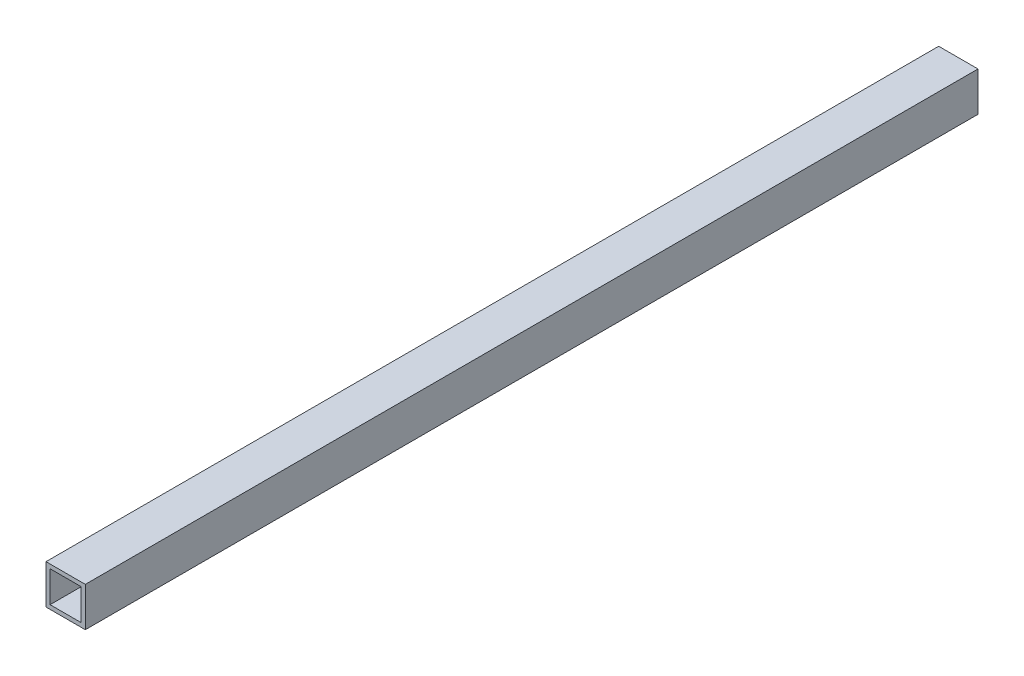
ISO-10303-21;
HEADER;
FILE_DESCRIPTION(('STEP AP214'),'2;1');
FILE_NAME('part.step','',(''),(''),'','','');
FILE_SCHEMA(('AUTOMOTIVE_DESIGN { 1 0 10303 214 1 1 1 1 }'));
ENDSEC;
DATA;
#1=APPLICATION_CONTEXT('core data for automotive mechanical design processes');
#2=APPLICATION_PROTOCOL_DEFINITION('international standard','automotive_design',2000,#1);
#3=PRODUCT_CONTEXT('',#1,'mechanical');
#4=PRODUCT('Part','Part','',(#3));
#5=PRODUCT_RELATED_PRODUCT_CATEGORY('part','',(#4));
#6=PRODUCT_DEFINITION_FORMATION('','',#4);
#7=PRODUCT_DEFINITION_CONTEXT('part definition',#1,'design');
#8=PRODUCT_DEFINITION('design','',#6,#7);
#9=PRODUCT_DEFINITION_SHAPE('','',#8);
#10=(LENGTH_UNIT() NAMED_UNIT(*) SI_UNIT(.MILLI.,.METRE.));
#11=(NAMED_UNIT(*) PLANE_ANGLE_UNIT() SI_UNIT($,.RADIAN.));
#12=(NAMED_UNIT(*) SI_UNIT($,.STERADIAN.) SOLID_ANGLE_UNIT());
#13=UNCERTAINTY_MEASURE_WITH_UNIT(LENGTH_MEASURE(1.E-05),#10,'distance_accuracy_value','');
#14=(GEOMETRIC_REPRESENTATION_CONTEXT(3) GLOBAL_UNCERTAINTY_ASSIGNED_CONTEXT((#13)) GLOBAL_UNIT_ASSIGNED_CONTEXT((#10,
#11,#12)) REPRESENTATION_CONTEXT('',''));
#15=CARTESIAN_POINT('',(0.,0.,0.));
#16=DIRECTION('',(0.,0.,1.));
#17=DIRECTION('',(1.,0.,0.));
#18=AXIS2_PLACEMENT_3D('',#15,#16,#17);
#19=CARTESIAN_POINT('',(0.,0.,545.));
#20=DIRECTION('',(0.,0.,-1.));
#21=DIRECTION('',(-1.,0.,0.));
#22=AXIS2_PLACEMENT_3D('',#19,#20,#21);
#23=PLANE('',#22);
#24=DIRECTION('',(0.,-1.,0.));
#25=VECTOR('',#24,1.);
#26=CARTESIAN_POINT('',(0.,0.,545.));
#27=LINE('',#26,#25);
#28=CARTESIAN_POINT('',(0.,24.,545.));
#29=VERTEX_POINT('',#28);
#30=CARTESIAN_POINT('',(0.,0.,545.));
#31=VERTEX_POINT('',#30);
#32=EDGE_CURVE('E136',#29,#31,#27,.T.);
#33=ORIENTED_EDGE('',*,*,#32,.T.);
#34=DIRECTION('',(1.,0.,0.));
#35=VECTOR('',#34,1.);
#36=CARTESIAN_POINT('',(0.,0.,545.));
#37=LINE('',#36,#35);
#38=CARTESIAN_POINT('',(24.,0.,545.));
#39=VERTEX_POINT('',#38);
#40=EDGE_CURVE('E139',#31,#39,#37,.T.);
#41=ORIENTED_EDGE('',*,*,#40,.T.);
#42=DIRECTION('',(0.,1.,0.));
#43=VECTOR('',#42,1.);
#44=CARTESIAN_POINT('',(24.,0.,545.));
#45=LINE('',#44,#43);
#46=CARTESIAN_POINT('',(24.,24.,545.));
#47=VERTEX_POINT('',#46);
#48=EDGE_CURVE('E142',#39,#47,#45,.T.);
#49=ORIENTED_EDGE('',*,*,#48,.T.);
#50=DIRECTION('',(-1.,0.,0.));
#51=VECTOR('',#50,1.);
#52=CARTESIAN_POINT('',(0.,24.,545.));
#53=LINE('',#52,#51);
#54=EDGE_CURVE('E144',#47,#29,#53,.T.);
#55=ORIENTED_EDGE('',*,*,#54,.T.);
#56=EDGE_LOOP('',(#33,#41,#49,#55));
#57=FACE_BOUND('',#56,.T.);
#58=DIRECTION('',(0.,-1.,0.));
#59=VECTOR('',#58,1.);
#60=CARTESIAN_POINT('',(2.5,2.5,545.));
#61=LINE('',#60,#59);
#62=CARTESIAN_POINT('',(2.5,21.5,545.));
#63=VERTEX_POINT('',#62);
#64=CARTESIAN_POINT('',(2.5,2.5,545.));
#65=VERTEX_POINT('',#64);
#66=EDGE_CURVE('E100',#63,#65,#61,.T.);
#67=ORIENTED_EDGE('',*,*,#66,.F.);
#68=DIRECTION('',(-1.,0.,0.));
#69=VECTOR('',#68,1.);
#70=CARTESIAN_POINT('',(2.5,21.5,545.));
#71=LINE('',#70,#69);
#72=CARTESIAN_POINT('',(21.5,21.5,545.));
#73=VERTEX_POINT('',#72);
#74=EDGE_CURVE('E122',#73,#63,#71,.T.);
#75=ORIENTED_EDGE('',*,*,#74,.F.);
#76=DIRECTION('',(0.,1.,0.));
#77=VECTOR('',#76,1.);
#78=CARTESIAN_POINT('',(21.5,2.5,545.));
#79=LINE('',#78,#77);
#80=CARTESIAN_POINT('',(21.5,2.5,545.));
#81=VERTEX_POINT('',#80);
#82=EDGE_CURVE('E120',#81,#73,#79,.T.);
#83=ORIENTED_EDGE('',*,*,#82,.F.);
#84=DIRECTION('',(1.,0.,0.));
#85=VECTOR('',#84,1.);
#86=CARTESIAN_POINT('',(2.5,2.5,545.));
#87=LINE('',#86,#85);
#88=EDGE_CURVE('E108',#65,#81,#87,.T.);
#89=ORIENTED_EDGE('',*,*,#88,.F.);
#90=EDGE_LOOP('',(#67,#75,#83,#89));
#91=FACE_BOUND('',#90,.T.);
#92=ADVANCED_FACE('F35',(#57,#91),#23,.F.);
#93=CARTESIAN_POINT('',(0.,0.,0.));
#94=DIRECTION('',(0.,0.,-1.));
#95=DIRECTION('',(-1.,0.,0.));
#96=AXIS2_PLACEMENT_3D('',#93,#94,#95);
#97=PLANE('',#96);
#98=DIRECTION('',(0.,-1.,0.));
#99=VECTOR('',#98,1.);
#100=CARTESIAN_POINT('',(0.,0.,0.));
#101=LINE('',#100,#99);
#102=CARTESIAN_POINT('',(0.,24.,0.));
#103=VERTEX_POINT('',#102);
#104=CARTESIAN_POINT('',(0.,0.,0.));
#105=VERTEX_POINT('',#104);
#106=EDGE_CURVE('E116',#103,#105,#101,.T.);
#107=ORIENTED_EDGE('',*,*,#106,.F.);
#108=DIRECTION('',(-1.,0.,0.));
#109=VECTOR('',#108,1.);
#110=CARTESIAN_POINT('',(0.,24.,0.));
#111=LINE('',#110,#109);
#112=CARTESIAN_POINT('',(24.,24.,0.));
#113=VERTEX_POINT('',#112);
#114=EDGE_CURVE('E140',#113,#103,#111,.T.);
#115=ORIENTED_EDGE('',*,*,#114,.F.);
#116=DIRECTION('',(0.,1.,0.));
#117=VECTOR('',#116,1.);
#118=CARTESIAN_POINT('',(24.,0.,0.));
#119=LINE('',#118,#117);
#120=CARTESIAN_POINT('',(24.,0.,0.));
#121=VERTEX_POINT('',#120);
#122=EDGE_CURVE('E151',#121,#113,#119,.T.);
#123=ORIENTED_EDGE('',*,*,#122,.F.);
#124=DIRECTION('',(1.,0.,0.));
#125=VECTOR('',#124,1.);
#126=CARTESIAN_POINT('',(0.,0.,0.));
#127=LINE('',#126,#125);
#128=EDGE_CURVE('E149',#105,#121,#127,.T.);
#129=ORIENTED_EDGE('',*,*,#128,.F.);
#130=EDGE_LOOP('',(#107,#115,#123,#129));
#131=FACE_BOUND('',#130,.T.);
#132=DIRECTION('',(-1.,0.,0.));
#133=VECTOR('',#132,1.);
#134=CARTESIAN_POINT('',(2.5,21.5,0.));
#135=LINE('',#134,#133);
#136=CARTESIAN_POINT('',(21.5,21.5,0.));
#137=VERTEX_POINT('',#136);
#138=CARTESIAN_POINT('',(2.5,21.5,0.));
#139=VERTEX_POINT('',#138);
#140=EDGE_CURVE('E109',#137,#139,#135,.T.);
#141=ORIENTED_EDGE('',*,*,#140,.T.);
#142=DIRECTION('',(0.,-1.,0.));
#143=VECTOR('',#142,1.);
#144=CARTESIAN_POINT('',(2.5,2.5,0.));
#145=LINE('',#144,#143);
#146=CARTESIAN_POINT('',(2.5,2.5,0.));
#147=VERTEX_POINT('',#146);
#148=EDGE_CURVE('E58',#139,#147,#145,.T.);
#149=ORIENTED_EDGE('',*,*,#148,.T.);
#150=DIRECTION('',(1.,0.,0.));
#151=VECTOR('',#150,1.);
#152=CARTESIAN_POINT('',(2.5,2.5,0.));
#153=LINE('',#152,#151);
#154=CARTESIAN_POINT('',(21.5,2.5,0.));
#155=VERTEX_POINT('',#154);
#156=EDGE_CURVE('E115',#147,#155,#153,.T.);
#157=ORIENTED_EDGE('',*,*,#156,.T.);
#158=DIRECTION('',(0.,1.,0.));
#159=VECTOR('',#158,1.);
#160=CARTESIAN_POINT('',(21.5,2.5,0.));
#161=LINE('',#160,#159);
#162=EDGE_CURVE('E128',#155,#137,#161,.T.);
#163=ORIENTED_EDGE('',*,*,#162,.T.);
#164=EDGE_LOOP('',(#141,#149,#157,#163));
#165=FACE_BOUND('',#164,.T.);
#166=ADVANCED_FACE('F169',(#131,#165),#97,.T.);
#167=CARTESIAN_POINT('',(0.,0.,545.));
#168=DIRECTION('',(1.,0.,0.));
#169=DIRECTION('',(0.,0.,-1.));
#170=AXIS2_PLACEMENT_3D('',#167,#168,#169);
#171=PLANE('',#170);
#172=ORIENTED_EDGE('',*,*,#106,.T.);
#173=DIRECTION('',(0.,0.,-1.));
#174=VECTOR('',#173,1.);
#175=CARTESIAN_POINT('',(0.,0.,545.));
#176=LINE('',#175,#174);
#177=EDGE_CURVE('E11',#31,#105,#176,.T.);
#178=ORIENTED_EDGE('',*,*,#177,.F.);
#179=ORIENTED_EDGE('',*,*,#32,.F.);
#180=DIRECTION('',(0.,0.,-1.));
#181=VECTOR('',#180,1.);
#182=CARTESIAN_POINT('',(0.,24.,545.));
#183=LINE('',#182,#181);
#184=EDGE_CURVE('E146',#29,#103,#183,.T.);
#185=ORIENTED_EDGE('',*,*,#184,.T.);
#186=EDGE_LOOP('',(#172,#178,#179,#185));
#187=FACE_BOUND('',#186,.T.);
#188=ADVANCED_FACE('F37',(#187),#171,.F.);
#189=CARTESIAN_POINT('',(0.,0.,545.));
#190=DIRECTION('',(0.,1.,0.));
#191=DIRECTION('',(0.,0.,1.));
#192=AXIS2_PLACEMENT_3D('',#189,#190,#191);
#193=PLANE('',#192);
#194=ORIENTED_EDGE('',*,*,#128,.T.);
#195=DIRECTION('',(0.,0.,-1.));
#196=VECTOR('',#195,1.);
#197=CARTESIAN_POINT('',(24.,0.,545.));
#198=LINE('',#197,#196);
#199=EDGE_CURVE('E43',#39,#121,#198,.T.);
#200=ORIENTED_EDGE('',*,*,#199,.F.);
#201=ORIENTED_EDGE('',*,*,#40,.F.);
#202=ORIENTED_EDGE('',*,*,#177,.T.);
#203=EDGE_LOOP('',(#194,#200,#201,#202));
#204=FACE_BOUND('',#203,.T.);
#205=ADVANCED_FACE('F179',(#204),#193,.F.);
#206=CARTESIAN_POINT('',(24.,0.,545.));
#207=DIRECTION('',(-1.,0.,0.));
#208=DIRECTION('',(0.,0.,1.));
#209=AXIS2_PLACEMENT_3D('',#206,#207,#208);
#210=PLANE('',#209);
#211=ORIENTED_EDGE('',*,*,#122,.T.);
#212=DIRECTION('',(0.,0.,-1.));
#213=VECTOR('',#212,1.);
#214=CARTESIAN_POINT('',(24.,24.,545.));
#215=LINE('',#214,#213);
#216=EDGE_CURVE('E156',#47,#113,#215,.T.);
#217=ORIENTED_EDGE('',*,*,#216,.F.);
#218=ORIENTED_EDGE('',*,*,#48,.F.);
#219=ORIENTED_EDGE('',*,*,#199,.T.);
#220=EDGE_LOOP('',(#211,#217,#218,#219));
#221=FACE_BOUND('',#220,.T.);
#222=ADVANCED_FACE('F163',(#221),#210,.F.);
#223=CARTESIAN_POINT('',(0.,24.,545.));
#224=DIRECTION('',(0.,-1.,0.));
#225=DIRECTION('',(0.,0.,-1.));
#226=AXIS2_PLACEMENT_3D('',#223,#224,#225);
#227=PLANE('',#226);
#228=ORIENTED_EDGE('',*,*,#114,.T.);
#229=ORIENTED_EDGE('',*,*,#184,.F.);
#230=ORIENTED_EDGE('',*,*,#54,.F.);
#231=ORIENTED_EDGE('',*,*,#216,.T.);
#232=EDGE_LOOP('',(#228,#229,#230,#231));
#233=FACE_BOUND('',#232,.T.);
#234=ADVANCED_FACE('F173',(#233),#227,.F.);
#235=CARTESIAN_POINT('',(2.5,2.5,545.));
#236=DIRECTION('',(1.,0.,0.));
#237=DIRECTION('',(0.,0.,-1.));
#238=AXIS2_PLACEMENT_3D('',#235,#236,#237);
#239=PLANE('',#238);
#240=ORIENTED_EDGE('',*,*,#148,.F.);
#241=DIRECTION('',(0.,0.,-1.));
#242=VECTOR('',#241,1.);
#243=CARTESIAN_POINT('',(2.5,21.5,545.));
#244=LINE('',#243,#242);
#245=EDGE_CURVE('E104',#63,#139,#244,.T.);
#246=ORIENTED_EDGE('',*,*,#245,.F.);
#247=ORIENTED_EDGE('',*,*,#66,.T.);
#248=DIRECTION('',(0.,0.,-1.));
#249=VECTOR('',#248,1.);
#250=CARTESIAN_POINT('',(2.5,2.5,545.));
#251=LINE('',#250,#249);
#252=EDGE_CURVE('E103',#65,#147,#251,.T.);
#253=ORIENTED_EDGE('',*,*,#252,.T.);
#254=EDGE_LOOP('',(#240,#246,#247,#253));
#255=FACE_BOUND('',#254,.T.);
#256=ADVANCED_FACE('F102',(#255),#239,.T.);
#257=CARTESIAN_POINT('',(2.5,2.5,545.));
#258=DIRECTION('',(0.,1.,0.));
#259=DIRECTION('',(0.,0.,1.));
#260=AXIS2_PLACEMENT_3D('',#257,#258,#259);
#261=PLANE('',#260);
#262=ORIENTED_EDGE('',*,*,#156,.F.);
#263=ORIENTED_EDGE('',*,*,#252,.F.);
#264=ORIENTED_EDGE('',*,*,#88,.T.);
#265=DIRECTION('',(0.,0.,-1.));
#266=VECTOR('',#265,1.);
#267=CARTESIAN_POINT('',(21.5,2.5,545.));
#268=LINE('',#267,#266);
#269=EDGE_CURVE('E117',#81,#155,#268,.T.);
#270=ORIENTED_EDGE('',*,*,#269,.T.);
#271=EDGE_LOOP('',(#262,#263,#264,#270));
#272=FACE_BOUND('',#271,.T.);
#273=ADVANCED_FACE('F112',(#272),#261,.T.);
#274=CARTESIAN_POINT('',(21.5,2.5,545.));
#275=DIRECTION('',(-1.,0.,0.));
#276=DIRECTION('',(0.,0.,1.));
#277=AXIS2_PLACEMENT_3D('',#274,#275,#276);
#278=PLANE('',#277);
#279=ORIENTED_EDGE('',*,*,#162,.F.);
#280=ORIENTED_EDGE('',*,*,#269,.F.);
#281=ORIENTED_EDGE('',*,*,#82,.T.);
#282=DIRECTION('',(0.,0.,-1.));
#283=VECTOR('',#282,1.);
#284=CARTESIAN_POINT('',(21.5,21.5,545.));
#285=LINE('',#284,#283);
#286=EDGE_CURVE('E50',#73,#137,#285,.T.);
#287=ORIENTED_EDGE('',*,*,#286,.T.);
#288=EDGE_LOOP('',(#279,#280,#281,#287));
#289=FACE_BOUND('',#288,.T.);
#290=ADVANCED_FACE('F202',(#289),#278,.T.);
#291=CARTESIAN_POINT('',(2.5,21.5,545.));
#292=DIRECTION('',(0.,-1.,0.));
#293=DIRECTION('',(0.,0.,-1.));
#294=AXIS2_PLACEMENT_3D('',#291,#292,#293);
#295=PLANE('',#294);
#296=ORIENTED_EDGE('',*,*,#140,.F.);
#297=ORIENTED_EDGE('',*,*,#286,.F.);
#298=ORIENTED_EDGE('',*,*,#74,.T.);
#299=ORIENTED_EDGE('',*,*,#245,.T.);
#300=EDGE_LOOP('',(#296,#297,#298,#299));
#301=FACE_BOUND('',#300,.T.);
#302=ADVANCED_FACE('F206',(#301),#295,.T.);
#303=CLOSED_SHELL('',(#92,#166,#188,#205,#222,#234,#256,#273,#290,#302));
#304=MANIFOLD_SOLID_BREP('B2',#303);
#305=ADVANCED_BREP_SHAPE_REPRESENTATION('',(#18,#304),#14);
#306=SHAPE_DEFINITION_REPRESENTATION(#9,#305);
ENDSEC;
END-ISO-10303-21;
